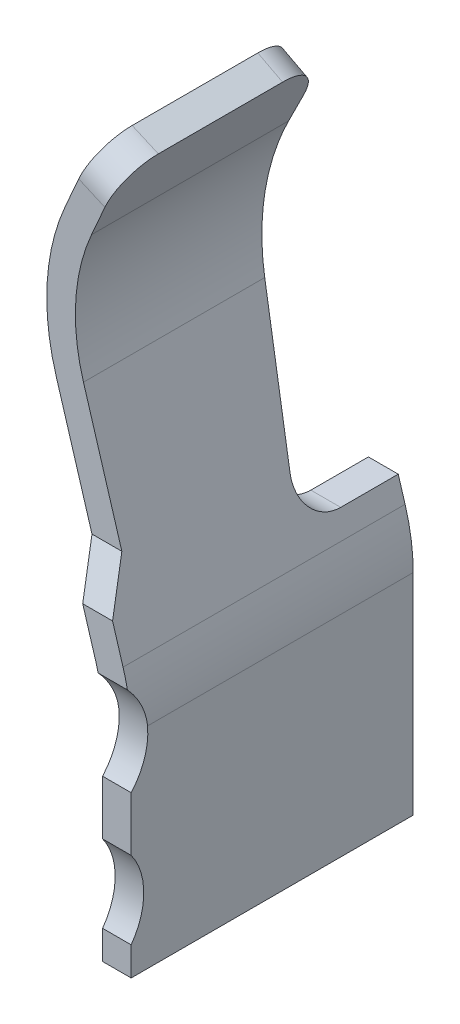
ISO-10303-21;
HEADER;
FILE_DESCRIPTION(('STEP AP214'),'2;1');
FILE_NAME('part.step','',(''),(''),'','','');
FILE_SCHEMA(('AUTOMOTIVE_DESIGN { 1 0 10303 214 1 1 1 1 }'));
ENDSEC;
DATA;
#1=APPLICATION_CONTEXT('core data for automotive mechanical design processes');
#2=APPLICATION_PROTOCOL_DEFINITION('international standard','automotive_design',2000,#1);
#3=PRODUCT_CONTEXT('',#1,'mechanical');
#4=PRODUCT('Part','Part','',(#3));
#5=PRODUCT_RELATED_PRODUCT_CATEGORY('part','',(#4));
#6=PRODUCT_DEFINITION_FORMATION('','',#4);
#7=PRODUCT_DEFINITION_CONTEXT('part definition',#1,'design');
#8=PRODUCT_DEFINITION('design','',#6,#7);
#9=PRODUCT_DEFINITION_SHAPE('','',#8);
#10=(LENGTH_UNIT() NAMED_UNIT(*) SI_UNIT(.MILLI.,.METRE.));
#11=(NAMED_UNIT(*) PLANE_ANGLE_UNIT() SI_UNIT($,.RADIAN.));
#12=(NAMED_UNIT(*) SI_UNIT($,.STERADIAN.) SOLID_ANGLE_UNIT());
#13=UNCERTAINTY_MEASURE_WITH_UNIT(LENGTH_MEASURE(1.E-05),#10,'distance_accuracy_value','');
#14=(GEOMETRIC_REPRESENTATION_CONTEXT(3) GLOBAL_UNCERTAINTY_ASSIGNED_CONTEXT((#13)) GLOBAL_UNIT_ASSIGNED_CONTEXT((#10,
#11,#12)) REPRESENTATION_CONTEXT('',''));
#15=CARTESIAN_POINT('',(0.,0.,0.));
#16=DIRECTION('',(0.,0.,1.));
#17=DIRECTION('',(1.,0.,0.));
#18=AXIS2_PLACEMENT_3D('',#15,#16,#17);
#19=CARTESIAN_POINT('',(12.0384449331811,3.52330708865174,0.423604352914839));
#20=DIRECTION('',(0.915327071470026,-0.402711251685505,0.));
#21=DIRECTION('',(0.402711251685505,0.915327071470026,0.));
#22=AXIS2_PLACEMENT_3D('',#19,#20,#21);
#23=CYLINDRICAL_SURFACE('',#22,0.2);
#24=CARTESIAN_POINT('',(12.0384449331811,3.52330708865174,0.423604352914839));
#25=DIRECTION('',(-0.915327071470029,0.402711251685498,0.));
#26=DIRECTION('',(0.402711251685498,0.915327071470029,0.));
#27=AXIS2_PLACEMENT_3D('',#24,#25,#26);
#28=CIRCLE('',#27,0.2);
#29=CARTESIAN_POINT('',(12.0384449331811,3.52330708865174,0.623604352914839));
#30=VERTEX_POINT('',#29);
#31=CARTESIAN_POINT('',(12.1189871835182,3.70637250294574,0.423604352914839));
#32=VERTEX_POINT('',#31);
#33=EDGE_CURVE('E498',#30,#32,#28,.T.);
#34=ORIENTED_EDGE('',*,*,#33,.F.);
#35=DIRECTION('',(-0.915327071470027,0.402711251685503,0.));
#36=VECTOR('',#35,1.);
#37=CARTESIAN_POINT('',(-12.5715059297135,14.3508073613119,0.623604352914805));
#38=LINE('',#37,#36);
#39=CARTESIAN_POINT('',(12.1757439939016,3.46290040089891,0.623604352914839));
#40=VERTEX_POINT('',#39);
#41=EDGE_CURVE('E27',#40,#30,#38,.T.);
#42=ORIENTED_EDGE('',*,*,#41,.F.);
#43=CARTESIAN_POINT('',(12.1757439939016,3.46290040089891,0.423604352914839));
#44=DIRECTION('',(0.915327071470029,-0.402711251685498,0.));
#45=DIRECTION('',(-0.402711251685498,-0.915327071470029,0.));
#46=AXIS2_PLACEMENT_3D('',#43,#44,#45);
#47=CIRCLE('',#46,0.2);
#48=CARTESIAN_POINT('',(12.2562862442387,3.64596581519291,0.423604352914839));
#49=VERTEX_POINT('',#48);
#50=EDGE_CURVE('E503',#49,#40,#47,.T.);
#51=ORIENTED_EDGE('',*,*,#50,.F.);
#52=DIRECTION('',(0.915327071470027,-0.402711251685503,0.));
#53=VECTOR('',#52,1.);
#54=CARTESIAN_POINT('',(12.1189871835182,3.70637250294574,0.423604352914839));
#55=LINE('',#54,#53);
#56=EDGE_CURVE('E539',#32,#49,#55,.T.);
#57=ORIENTED_EDGE('',*,*,#56,.F.);
#58=EDGE_LOOP('',(#34,#42,#51,#57));
#59=FACE_BOUND('',#58,.T.);
#60=ADVANCED_FACE('F16',(#59),#23,.T.);
#61=CARTESIAN_POINT('',(12.01613725867,3.53312166947706,-0.236832722369337));
#62=DIRECTION('',(-0.914255270392897,0.402239697454475,-0.0483789866630451));
#63=DIRECTION('',(-0.402711251685505,-0.915327071470026,0.));
#64=AXIS2_PLACEMENT_3D('',#61,#62,#63);
#65=CYLINDRICAL_SURFACE('',#64,0.2);
#66=CARTESIAN_POINT('',(12.1669405380458,3.44289092405021,-0.427421697659668));
#67=CARTESIAN_POINT('',(12.2180174651924,3.55898426375477,-0.441384710680955));
#68=CARTESIAN_POINT('',(12.2562862442387,3.64596581519291,-0.356133634256614));
#69=CARTESIAN_POINT('',(12.2562862442387,3.64596581519291,-0.228386927890316));
#70=(BOUNDED_CURVE() B_SPLINE_CURVE(3,(#66,#67,#68,#69),.UNSPECIFIED.,.F.,
.F.) B_SPLINE_CURVE_WITH_KNOTS((4,4),(6.17366415670651,7.85398163397443),
.UNSPECIFIED.) CURVE() GEOMETRIC_REPRESENTATION_ITEM() RATIONAL_B_SPLINE_CURVE((1.,
0.778229742533869,0.778229742533869,1.)) REPRESENTATION_ITEM(''));
#71=CARTESIAN_POINT('',(12.1669405380458,3.44289092405021,-0.427421697659668));
#72=VERTEX_POINT('',#71);
#73=CARTESIAN_POINT('',(12.2562862442387,3.64596581519291,-0.228386927890316));
#74=VERTEX_POINT('',#73);
#75=EDGE_CURVE('E508',#72,#74,#70,.T.);
#76=ORIENTED_EDGE('',*,*,#75,.F.);
#77=DIRECTION('',(0.914255270392898,-0.402239697454473,0.0483789866630451));
#78=VECTOR('',#77,1.);
#79=CARTESIAN_POINT('',(-13.171852655037,14.5910558161891,-1.76825633941021));
#80=LINE('',#79,#78);
#81=CARTESIAN_POINT('',(12.0296414773253,3.50329761180303,-0.434687053017796));
#82=VERTEX_POINT('',#81);
#83=EDGE_CURVE('E11',#82,#72,#80,.T.);
#84=ORIENTED_EDGE('',*,*,#83,.F.);
#85=CARTESIAN_POINT('',(12.1189871835182,3.70637250294574,-0.235652283248443));
#86=CARTESIAN_POINT('',(12.1189871835182,3.70637250294574,-0.363398989614741));
#87=CARTESIAN_POINT('',(12.0807184044719,3.61939095150759,-0.448650066039082));
#88=CARTESIAN_POINT('',(12.0296414773253,3.50329761180303,-0.434687053017796));
#89=(BOUNDED_CURVE() B_SPLINE_CURVE(3,(#85,#86,#87,#88),.UNSPECIFIED.,.F.,
.F.) B_SPLINE_CURVE_WITH_KNOTS((4,4),(4.71238898038476,6.39270645765268),
.UNSPECIFIED.) CURVE() GEOMETRIC_REPRESENTATION_ITEM() RATIONAL_B_SPLINE_CURVE((1.,
0.778229742533871,0.778229742533871,1.)) REPRESENTATION_ITEM(''));
#90=CARTESIAN_POINT('',(12.1189871835182,3.70637250294574,-0.235652283248443));
#91=VERTEX_POINT('',#90);
#92=EDGE_CURVE('E244',#91,#82,#89,.T.);
#93=ORIENTED_EDGE('',*,*,#92,.F.);
#94=DIRECTION('',(-0.914255270392898,0.402239697454473,-0.0483789866630451));
#95=VECTOR('',#94,1.);
#96=CARTESIAN_POINT('',(12.0966795090071,3.71618708377106,-0.236832722369337));
#97=LINE('',#96,#95);
#98=EDGE_CURVE('E497',#74,#91,#97,.T.);
#99=ORIENTED_EDGE('',*,*,#98,.F.);
#100=EDGE_LOOP('',(#76,#84,#93,#99));
#101=FACE_BOUND('',#100,.T.);
#102=ADVANCED_FACE('F326',(#101),#65,.T.);
#103=CARTESIAN_POINT('',(-18.03,1.65634067151207,-0.212546111318104));
#104=DIRECTION('',(0.,-1.,0.));
#105=DIRECTION('',(0.,0.,-1.));
#106=AXIS2_PLACEMENT_3D('',#103,#104,#105);
#107=PLANE('',#106);
#108=DIRECTION('',(0.,0.,-1.));
#109=VECTOR('',#108,1.);
#110=CARTESIAN_POINT('',(12.1948350789415,1.65634067151207,-0.740000000000018));
#111=LINE('',#110,#109);
#112=CARTESIAN_POINT('',(12.1948350789415,1.65634067151207,-0.438042305987952));
#113=VERTEX_POINT('',#112);
#114=CARTESIAN_POINT('',(12.1948350789415,1.65634067151207,-0.740000000000018));
#115=VERTEX_POINT('',#114);
#116=EDGE_CURVE('E492',#113,#115,#111,.T.);
#117=ORIENTED_EDGE('',*,*,#116,.F.);
#118=DIRECTION('',(1.,0.,0.));
#119=VECTOR('',#118,1.);
#120=CARTESIAN_POINT('',(12.3515034091056,1.65634067151207,-0.438042305987951));
#121=LINE('',#120,#119);
#122=CARTESIAN_POINT('',(12.3515034091056,1.65634067151207,-0.438042305987951));
#123=VERTEX_POINT('',#122);
#124=EDGE_CURVE('E456',#113,#123,#121,.T.);
#125=ORIENTED_EDGE('',*,*,#124,.T.);
#126=DIRECTION('',(0.,0.,1.));
#127=VECTOR('',#126,1.);
#128=CARTESIAN_POINT('',(12.3515034091056,1.65634067151207,-0.740000000000018));
#129=LINE('',#128,#127);
#130=CARTESIAN_POINT('',(12.3515034091056,1.65634067151207,-0.740000000000018));
#131=VERTEX_POINT('',#130);
#132=EDGE_CURVE('E524',#131,#123,#129,.T.);
#133=ORIENTED_EDGE('',*,*,#132,.F.);
#134=DIRECTION('',(-1.,0.,0.));
#135=VECTOR('',#134,1.);
#136=CARTESIAN_POINT('',(11.43,1.65634067151207,-0.740000000000019));
#137=LINE('',#136,#135);
#138=EDGE_CURVE('E254',#131,#115,#137,.T.);
#139=ORIENTED_EDGE('',*,*,#138,.T.);
#140=EDGE_LOOP('',(#117,#125,#133,#139));
#141=FACE_BOUND('',#140,.T.);
#142=ADVANCED_FACE('F362',(#141),#107,.F.);
#143=CARTESIAN_POINT('',(-18.03,3.70637250294571,-0.459111687165995));
#144=DIRECTION('',(0.,0.119413416546905,0.992844618230162));
#145=DIRECTION('',(1.,0.,0.));
#146=AXIS2_PLACEMENT_3D('',#143,#144,#145);
#147=PLANE('',#146);
#148=DIRECTION('',(-0.28674853992682,0.951150986717314,-0.11439875574724));
#149=VECTOR('',#148,1.);
#150=CARTESIAN_POINT('',(12.3696639548885,1.59610175610151,-0.205300934614502));
#151=LINE('',#150,#149);
#152=CARTESIAN_POINT('',(12.2840083074336,1.88022335482146,-0.239473382341919));
#153=VERTEX_POINT('',#152);
#154=CARTESIAN_POINT('',(12.0634137359037,2.61194022573825,-0.327479914176621));
#155=VERTEX_POINT('',#154);
#156=EDGE_CURVE('E521',#153,#155,#151,.T.);
#157=ORIENTED_EDGE('',*,*,#156,.F.);
#158=DIRECTION('',(-1.,0.,0.));
#159=VECTOR('',#158,1.);
#160=CARTESIAN_POINT('',(12.1948350789415,1.88022335482146,-0.23947338234192));
#161=LINE('',#160,#159);
#162=CARTESIAN_POINT('',(12.1273399772696,1.88022335482146,-0.23947338234192));
#163=VERTEX_POINT('',#162);
#164=EDGE_CURVE('E255',#153,#163,#161,.T.);
#165=ORIENTED_EDGE('',*,*,#164,.T.);
#166=DIRECTION('',(0.286748539926818,-0.951150986717315,0.11439875574724));
#167=VECTOR('',#166,1.);
#168=CARTESIAN_POINT('',(12.2258776351119,1.55337185451571,-0.200161637444145));
#169=LINE('',#168,#167);
#170=CARTESIAN_POINT('',(11.9197982395462,2.56864369924933,-0.322272466749579));
#171=VERTEX_POINT('',#170);
#172=EDGE_CURVE('E520',#171,#163,#169,.T.);
#173=ORIENTED_EDGE('',*,*,#172,.F.);
#174=CARTESIAN_POINT('',(11.9682242460961,3.36370167510267,-0.417897288102545));
#175=CARTESIAN_POINT('',(11.8566992050933,3.11021511680704,-0.387409439934768));
#176=CARTESIAN_POINT('',(11.839862605404,2.83379189253285,-0.354162906673266));
#177=CARTESIAN_POINT('',(11.9197982395462,2.56864369924933,-0.322272466749579));
#178=(BOUNDED_CURVE() B_SPLINE_CURVE(3,(#174,#175,#176,#177),.UNSPECIFIED.,.F.,
.F.) B_SPLINE_CURVE_WITH_KNOTS((4,4),(4.29791199977039,5.00519872138853),
.UNSPECIFIED.) CURVE() GEOMETRIC_REPRESENTATION_ITEM() RATIONAL_B_SPLINE_CURVE((1.,
0.958744787021091,0.958744787021091,1.)) REPRESENTATION_ITEM(''));
#179=CARTESIAN_POINT('',(11.9682242460961,3.36370167510267,-0.417897288102545));
#180=VERTEX_POINT('',#179);
#181=EDGE_CURVE('E452',#180,#171,#178,.T.);
#182=ORIENTED_EDGE('',*,*,#181,.F.);
#183=DIRECTION('',(-0.400292818236851,-0.909830186054405,0.109428936813832));
#184=VECTOR('',#183,1.);
#185=CARTESIAN_POINT('',(11.9823335100882,3.39577078475993,-0.421754368938234));
#186=LINE('',#185,#184);
#187=EDGE_CURVE('E546',#82,#180,#186,.T.);
#188=ORIENTED_EDGE('',*,*,#187,.F.);
#189=ORIENTED_EDGE('',*,*,#83,.T.);
#190=DIRECTION('',(0.400292818236852,0.909830186054405,-0.109428936813832));
#191=VECTOR('',#190,1.);
#192=CARTESIAN_POINT('',(12.1199508196559,3.33608744850051,-0.414576013974332));
#193=LINE('',#192,#191);
#194=CARTESIAN_POINT('',(12.1055233068166,3.30329498734983,-0.410631932744417));
#195=VERTEX_POINT('',#194);
#196=EDGE_CURVE('E530',#195,#72,#193,.T.);
#197=ORIENTED_EDGE('',*,*,#196,.F.);
#198=CARTESIAN_POINT('',(12.0634137359037,2.61194022573825,-0.327479914176621));
#199=CARTESIAN_POINT('',(11.9939044888234,2.84250387207174,-0.355210731501565));
#200=CARTESIAN_POINT('',(12.0085450102924,3.08287189317973,-0.384120760424611));
#201=CARTESIAN_POINT('',(12.1055233068166,3.30329498734983,-0.410631932744417));
#202=(BOUNDED_CURVE() B_SPLINE_CURVE(3,(#198,#199,#200,#201),.UNSPECIFIED.,.F.,
.F.) B_SPLINE_CURVE_WITH_KNOTS((4,4),(1.27798658579106,1.98527330740919),
.UNSPECIFIED.) CURVE() GEOMETRIC_REPRESENTATION_ITEM() RATIONAL_B_SPLINE_CURVE((1.,
0.958744787021091,0.958744787021091,1.)) REPRESENTATION_ITEM(''));
#203=EDGE_CURVE('E279',#155,#195,#202,.T.);
#204=ORIENTED_EDGE('',*,*,#203,.F.);
#205=EDGE_LOOP('',(#157,#165,#173,#182,#188,#189,#197,#204));
#206=FACE_BOUND('',#205,.T.);
#207=ADVANCED_FACE('F674',(#206),#147,.F.);
#208=CARTESIAN_POINT('',(-18.03,1.94413292378283,0.623604352914797));
#209=DIRECTION('',(0.,0.,-1.));
#210=DIRECTION('',(0.,-1.,0.));
#211=AXIS2_PLACEMENT_3D('',#208,#209,#210);
#212=PLANE('',#211);
#213=DIRECTION('',(-0.402711251685501,-0.915327071470028,0.));
#214=VECTOR('',#213,1.);
#215=CARTESIAN_POINT('',(12.1055233068166,3.30329498734984,0.623604352914839));
#216=LINE('',#215,#214);
#217=CARTESIAN_POINT('',(12.1055233068166,3.30329498734984,0.623604352914839));
#218=VERTEX_POINT('',#217);
#219=EDGE_CURVE('E507',#40,#218,#216,.T.);
#220=ORIENTED_EDGE('',*,*,#219,.F.);
#221=ORIENTED_EDGE('',*,*,#41,.T.);
#222=DIRECTION('',(0.4027112516855,0.915327071470028,0.));
#223=VECTOR('',#222,1.);
#224=CARTESIAN_POINT('',(11.9682242460961,3.36370167510267,0.623604352914839));
#225=LINE('',#224,#223);
#226=CARTESIAN_POINT('',(11.9682242460961,3.36370167510267,0.623604352914839));
#227=VERTEX_POINT('',#226);
#228=EDGE_CURVE('E542',#227,#30,#225,.T.);
#229=ORIENTED_EDGE('',*,*,#228,.F.);
#230=CARTESIAN_POINT('',(13.0208503782866,2.90058373566433,0.62360435291484));
#231=DIRECTION('',(0.,0.,-1.));
#232=DIRECTION('',(-1.,0.,0.));
#233=AXIS2_PLACEMENT_3D('',#230,#231,#232);
#234=CIRCLE('',#233,1.15);
#235=CARTESIAN_POINT('',(11.9197982395462,2.56864369924933,0.623604352914839));
#236=VERTEX_POINT('',#235);
#237=EDGE_CURVE('E245',#236,#227,#234,.T.);
#238=ORIENTED_EDGE('',*,*,#237,.F.);
#239=DIRECTION('',(-0.288643509926088,0.957436642382956,0.));
#240=VECTOR('',#239,1.);
#241=CARTESIAN_POINT('',(12.2438211460255,1.49385284836845,0.623604352914839));
#242=LINE('',#241,#240);
#243=CARTESIAN_POINT('',(12.1080728200643,1.94413292378283,0.623604352914839));
#244=VERTEX_POINT('',#243);
#245=EDGE_CURVE('E536',#244,#236,#242,.T.);
#246=ORIENTED_EDGE('',*,*,#245,.F.);
#247=DIRECTION('',(1.,0.,0.));
#248=VECTOR('',#247,1.);
#249=CARTESIAN_POINT('',(-18.03,1.94413292378283,0.623604352914797));
#250=LINE('',#249,#248);
#251=CARTESIAN_POINT('',(12.2647411502284,1.94413292378283,0.623604352914839));
#252=VERTEX_POINT('',#251);
#253=EDGE_CURVE('E575',#244,#252,#250,.T.);
#254=ORIENTED_EDGE('',*,*,#253,.T.);
#255=DIRECTION('',(0.28864350992609,-0.957436642382956,0.));
#256=VECTOR('',#255,1.);
#257=CARTESIAN_POINT('',(12.387436642383,1.53714937485737,0.623604352914839));
#258=LINE('',#257,#256);
#259=CARTESIAN_POINT('',(12.0634137359037,2.61194022573825,0.623604352914839));
#260=VERTEX_POINT('',#259);
#261=EDGE_CURVE('E523',#260,#252,#258,.T.);
#262=ORIENTED_EDGE('',*,*,#261,.F.);
#263=CARTESIAN_POINT('',(13.0208503782866,2.90058373566433,0.62360435291484));
#264=DIRECTION('',(0.,0.,1.));
#265=DIRECTION('',(-1.,0.,0.));
#266=AXIS2_PLACEMENT_3D('',#263,#264,#265);
#267=CIRCLE('',#266,1.);
#268=EDGE_CURVE('E274',#218,#260,#267,.T.);
#269=ORIENTED_EDGE('',*,*,#268,.F.);
#270=EDGE_LOOP('',(#220,#221,#229,#238,#246,#254,#262,#269));
#271=FACE_BOUND('',#270,.T.);
#272=ADVANCED_FACE('F680',(#271),#212,.F.);
#273=CARTESIAN_POINT('',(-18.03,1.7003498353216,0.749999999999972));
#274=DIRECTION('',(0.,-0.460287319631494,-0.887770005906065));
#275=DIRECTION('',(0.,-0.887770005906065,0.460287319631494));
#276=AXIS2_PLACEMENT_3D('',#273,#274,#275);
#277=PLANE('',#276);
#278=DIRECTION('',(-1.,0.,0.));
#279=VECTOR('',#278,1.);
#280=CARTESIAN_POINT('',(11.43,1.7196371362757,0.739999999999981));
#281=LINE('',#280,#279);
#282=CARTESIAN_POINT('',(12.3324210876793,1.7196371362757,0.739999999999982));
#283=VERTEX_POINT('',#282);
#284=CARTESIAN_POINT('',(12.1757527575152,1.7196371362757,0.739999999999982));
#285=VERTEX_POINT('',#284);
#286=EDGE_CURVE('E486',#283,#285,#281,.T.);
#287=ORIENTED_EDGE('',*,*,#286,.F.);
#288=DIRECTION('',(0.258541028225372,-0.857586072334425,0.444637678635293));
#289=VECTOR('',#288,1.);
#290=CARTESIAN_POINT('',(12.2064234383064,2.13757401070795,0.523309818502748));
#291=LINE('',#290,#289);
#292=EDGE_CURVE('E251',#252,#283,#291,.T.);
#293=ORIENTED_EDGE('',*,*,#292,.F.);
#294=ORIENTED_EDGE('',*,*,#253,.F.);
#295=DIRECTION('',(-0.258541028225371,0.857586072334425,-0.444637678635293));
#296=VECTOR('',#295,1.);
#297=CARTESIAN_POINT('',(12.0602273619162,2.10283732290249,0.541319952677684));
#298=LINE('',#297,#296);
#299=EDGE_CURVE('E491',#285,#244,#298,.T.);
#300=ORIENTED_EDGE('',*,*,#299,.F.);
#301=EDGE_LOOP('',(#287,#293,#294,#300));
#302=FACE_BOUND('',#301,.T.);
#303=ADVANCED_FACE('F695',(#302),#277,.F.);
#304=CARTESIAN_POINT('',(11.43,1.24850586493128,0.739999999999981));
#305=DIRECTION('',(0.,0.,-1.));
#306=DIRECTION('',(0.,-1.,0.));
#307=AXIS2_PLACEMENT_3D('',#304,#305,#306);
#308=PLANE('',#307);
#309=DIRECTION('',(0.,-1.,0.));
#310=VECTOR('',#309,1.);
#311=CARTESIAN_POINT('',(12.43,0.145965815192914,0.739999999999982));
#312=LINE('',#311,#310);
#313=CARTESIAN_POINT('',(12.43,0.296740599868486,0.739999999999982));
#314=VERTEX_POINT('',#313);
#315=CARTESIAN_POINT('',(12.43,0.145965815192914,0.739999999999982));
#316=VERTEX_POINT('',#315);
#317=EDGE_CURVE('E201',#314,#316,#312,.T.);
#318=ORIENTED_EDGE('',*,*,#317,.F.);
#319=DIRECTION('',(-1.,0.,0.));
#320=VECTOR('',#319,1.);
#321=CARTESIAN_POINT('',(-18.03,0.296740599868486,0.73999999999994));
#322=LINE('',#321,#320);
#323=CARTESIAN_POINT('',(12.28,0.296740599868486,0.739999999999982));
#324=VERTEX_POINT('',#323);
#325=EDGE_CURVE('E205',#314,#324,#322,.T.);
#326=ORIENTED_EDGE('',*,*,#325,.T.);
#327=DIRECTION('',(0.,1.,0.));
#328=VECTOR('',#327,1.);
#329=CARTESIAN_POINT('',(12.28,0.145965815192914,0.739999999999982));
#330=LINE('',#329,#328);
#331=CARTESIAN_POINT('',(12.28,0.145965815192914,0.739999999999982));
#332=VERTEX_POINT('',#331);
#333=EDGE_CURVE('E502',#332,#324,#330,.T.);
#334=ORIENTED_EDGE('',*,*,#333,.F.);
#335=DIRECTION('',(-1.,0.,0.));
#336=VECTOR('',#335,1.);
#337=CARTESIAN_POINT('',(12.28,0.145965815192914,0.739999999999982));
#338=LINE('',#337,#336);
#339=EDGE_CURVE('E208',#316,#332,#338,.T.);
#340=ORIENTED_EDGE('',*,*,#339,.F.);
#341=EDGE_LOOP('',(#318,#326,#334,#340));
#342=FACE_BOUND('',#341,.T.);
#343=ADVANCED_FACE('F203',(#342),#308,.F.);
#344=CARTESIAN_POINT('',(11.43,1.24850586493128,-0.740000000000019));
#345=DIRECTION('',(0.,0.,-1.));
#346=DIRECTION('',(0.,-1.,0.));
#347=AXIS2_PLACEMENT_3D('',#344,#345,#346);
#348=PLANE('',#347);
#349=ORIENTED_EDGE('',*,*,#138,.F.);
#350=DIRECTION('',(0.28864350992609,-0.957436642382956,0.));
#351=VECTOR('',#350,1.);
#352=CARTESIAN_POINT('',(12.387436642383,1.53714937485737,-0.740000000000018));
#353=LINE('',#352,#351);
#354=CARTESIAN_POINT('',(12.387436642383,1.53714937485737,-0.740000000000018));
#355=VERTEX_POINT('',#354);
#356=EDGE_CURVE('E278',#131,#355,#353,.T.);
#357=ORIENTED_EDGE('',*,*,#356,.T.);
#358=CARTESIAN_POINT('',(11.43,1.24850586493128,-0.740000000000019));
#359=DIRECTION('',(0.,0.,-1.));
#360=DIRECTION('',(-1.,0.,0.));
#361=AXIS2_PLACEMENT_3D('',#358,#359,#360);
#362=CIRCLE('',#361,1.);
#363=CARTESIAN_POINT('',(12.43,1.24850586493128,-0.740000000000018));
#364=VERTEX_POINT('',#363);
#365=EDGE_CURVE('E211',#355,#364,#362,.T.);
#366=ORIENTED_EDGE('',*,*,#365,.T.);
#367=DIRECTION('',(0.,-1.,0.));
#368=VECTOR('',#367,1.);
#369=CARTESIAN_POINT('',(12.43,0.145965815192914,-0.740000000000018));
#370=LINE('',#369,#368);
#371=CARTESIAN_POINT('',(12.43,0.145965815192914,-0.740000000000018));
#372=VERTEX_POINT('',#371);
#373=EDGE_CURVE('E42',#364,#372,#370,.T.);
#374=ORIENTED_EDGE('',*,*,#373,.T.);
#375=DIRECTION('',(-1.,0.,0.));
#376=VECTOR('',#375,1.);
#377=CARTESIAN_POINT('',(12.28,0.145965815192914,-0.740000000000018));
#378=LINE('',#377,#376);
#379=CARTESIAN_POINT('',(12.28,0.145965815192914,-0.740000000000018));
#380=VERTEX_POINT('',#379);
#381=EDGE_CURVE('E273',#372,#380,#378,.T.);
#382=ORIENTED_EDGE('',*,*,#381,.T.);
#383=DIRECTION('',(0.,1.,0.));
#384=VECTOR('',#383,1.);
#385=CARTESIAN_POINT('',(12.28,0.145965815192914,-0.740000000000018));
#386=LINE('',#385,#384);
#387=CARTESIAN_POINT('',(12.28,1.24850586493128,-0.740000000000018));
#388=VERTEX_POINT('',#387);
#389=EDGE_CURVE('E376',#380,#388,#386,.T.);
#390=ORIENTED_EDGE('',*,*,#389,.T.);
#391=CARTESIAN_POINT('',(11.43,1.24850586493128,-0.740000000000019));
#392=DIRECTION('',(0.,0.,1.));
#393=DIRECTION('',(-1.,0.,0.));
#394=AXIS2_PLACEMENT_3D('',#391,#392,#393);
#395=CIRCLE('',#394,0.85);
#396=CARTESIAN_POINT('',(12.2438211460255,1.49385284836845,-0.740000000000018));
#397=VERTEX_POINT('',#396);
#398=EDGE_CURVE('E556',#388,#397,#395,.T.);
#399=ORIENTED_EDGE('',*,*,#398,.T.);
#400=DIRECTION('',(-0.288643509926088,0.957436642382956,0.));
#401=VECTOR('',#400,1.);
#402=CARTESIAN_POINT('',(12.2438211460255,1.49385284836845,-0.740000000000018));
#403=LINE('',#402,#401);
#404=EDGE_CURVE('E487',#397,#115,#403,.T.);
#405=ORIENTED_EDGE('',*,*,#404,.T.);
#406=EDGE_LOOP('',(#349,#357,#366,#374,#382,#390,#399,#405));
#407=FACE_BOUND('',#406,.T.);
#408=ADVANCED_FACE('F432',(#407),#348,.T.);
#409=CARTESIAN_POINT('',(12.43,0.145965815192914,-0.740000000000018));
#410=DIRECTION('',(-1.,0.,0.));
#411=DIRECTION('',(0.,0.,1.));
#412=AXIS2_PLACEMENT_3D('',#409,#410,#411);
#413=PLANE('',#412);
#414=DIRECTION('',(0.,0.,1.));
#415=VECTOR('',#414,1.);
#416=CARTESIAN_POINT('',(12.43,1.24850586493128,-0.740000000000018));
#417=LINE('',#416,#415);
#418=CARTESIAN_POINT('',(12.43,1.24850586493128,0.654029100989327));
#419=VERTEX_POINT('',#418);
#420=EDGE_CURVE('E250',#364,#419,#417,.T.);
#421=ORIENTED_EDGE('',*,*,#420,.T.);
#422=CARTESIAN_POINT('',(12.43,1.21669179396546,0.995153761033099));
#423=DIRECTION('',(1.,0.,0.));
#424=DIRECTION('',(0.,0.,1.));
#425=AXIS2_PLACEMENT_3D('',#422,#423,#424);
#426=CIRCLE('',#425,0.342604974863759);
#427=CARTESIAN_POINT('',(12.43,0.988055123608201,0.739999999999982));
#428=VERTEX_POINT('',#427);
#429=EDGE_CURVE('E404',#428,#419,#426,.T.);
#430=ORIENTED_EDGE('',*,*,#429,.F.);
#431=DIRECTION('',(0.,-1.,0.));
#432=VECTOR('',#431,1.);
#433=CARTESIAN_POINT('',(12.43,0.145965815192914,0.739999999999982));
#434=LINE('',#433,#432);
#435=CARTESIAN_POINT('',(12.43,0.703259400131467,0.739999999999982));
#436=VERTEX_POINT('',#435);
#437=EDGE_CURVE('E217',#428,#436,#434,.T.);
#438=ORIENTED_EDGE('',*,*,#437,.T.);
#439=CARTESIAN_POINT('',(12.43,0.499999999999977,1.01942683457021));
#440=DIRECTION('',(1.,0.,0.));
#441=DIRECTION('',(0.,0.,1.));
#442=AXIS2_PLACEMENT_3D('',#439,#440,#441);
#443=CIRCLE('',#442,0.345533991988848);
#444=EDGE_CURVE('E214',#314,#436,#443,.T.);
#445=ORIENTED_EDGE('',*,*,#444,.F.);
#446=ORIENTED_EDGE('',*,*,#317,.T.);
#447=DIRECTION('',(0.,0.,1.));
#448=VECTOR('',#447,1.);
#449=CARTESIAN_POINT('',(12.43,0.145965815192914,-0.740000000000018));
#450=LINE('',#449,#448);
#451=EDGE_CURVE('E377',#372,#316,#450,.T.);
#452=ORIENTED_EDGE('',*,*,#451,.F.);
#453=ORIENTED_EDGE('',*,*,#373,.F.);
#454=EDGE_LOOP('',(#421,#430,#438,#445,#446,#452,#453));
#455=FACE_BOUND('',#454,.T.);
#456=ADVANCED_FACE('F215',(#455),#413,.F.);
#457=CARTESIAN_POINT('',(11.43,1.24850586493128,-0.740000000000019));
#458=DIRECTION('',(0.,0.,1.));
#459=DIRECTION('',(1.,0.,0.));
#460=AXIS2_PLACEMENT_3D('',#457,#458,#459);
#461=CYLINDRICAL_SURFACE('',#460,1.);
#462=CARTESIAN_POINT('',(11.43,1.24850586493128,0.739999999999981));
#463=DIRECTION('',(0.,0.,-1.));
#464=DIRECTION('',(-1.,0.,0.));
#465=AXIS2_PLACEMENT_3D('',#462,#463,#464);
#466=CIRCLE('',#465,1.);
#467=CARTESIAN_POINT('',(12.387436642383,1.53714937485737,0.739999999999982));
#468=VERTEX_POINT('',#467);
#469=CARTESIAN_POINT('',(12.4104391181347,1.44532846432271,0.739999999999982));
#470=VERTEX_POINT('',#469);
#471=EDGE_CURVE('E349',#468,#470,#466,.T.);
#472=ORIENTED_EDGE('',*,*,#471,.T.);
#473=CARTESIAN_POINT('',(12.4104391181347,1.44532846432271,0.739999999999982));
#474=CARTESIAN_POINT('',(12.4111213174168,1.44193024717415,0.736954698545483));
#475=CARTESIAN_POINT('',(12.4117972185085,1.43847176034261,0.733975045899647));
#476=CARTESIAN_POINT('',(12.413128559526,1.43145643098154,0.728168909339827));
#477=CARTESIAN_POINT('',(12.4137840893163,1.42790021102147,0.725341693611728));
#478=CARTESIAN_POINT('',(12.4150716881698,1.42068928784935,0.719840380711008));
#479=CARTESIAN_POINT('',(12.4157038382793,1.41703501951568,0.717165732805341));
#480=CARTESIAN_POINT('',(12.4169415721266,1.40962817005595,0.711969336935122));
#481=CARTESIAN_POINT('',(12.4175472155213,1.40587584366096,0.709447240161576));
#482=CARTESIAN_POINT('',(12.4187287712969,1.39827302810681,0.704555749407115));
#483=CARTESIAN_POINT('',(12.4193047088885,1.3944226264711,0.702186225501711));
#484=CARTESIAN_POINT('',(12.420423617226,1.38662388081484,0.697599649617144));
#485=CARTESIAN_POINT('',(12.4209665658168,1.3826754734274,0.69538269997563));
#486=CARTESIAN_POINT('',(12.42201619605,1.37468096295884,0.691101059928042));
#487=CARTESIAN_POINT('',(12.4225227957389,1.3706346650176,0.689036713287184));
#488=CARTESIAN_POINT('',(12.423496351594,1.36244473872731,0.685059955148846));
#489=CARTESIAN_POINT('',(12.4239631543961,1.35830080604147,0.683148133100285));
#490=CARTESIAN_POINT('',(12.4248538510173,1.34991442649085,0.679475891500457));
#491=CARTESIAN_POINT('',(12.425277495071,1.3456715635432,0.677716361222163));
#492=CARTESIAN_POINT('',(12.4260735280579,1.33713872195209,0.67437603386877));
#493=CARTESIAN_POINT('',(12.426446189351,1.33284913740262,0.672794295796519));
#494=CARTESIAN_POINT('',(12.4271386385479,1.32422362544475,0.669809238507238));
#495=CARTESIAN_POINT('',(12.42745863415,1.31988795555412,0.668405223722607));
#496=CARTESIAN_POINT('',(12.4280441441101,1.31117101253237,0.665775382478343));
#497=CARTESIAN_POINT('',(12.4283097914247,1.3067898789237,0.664549123358626));
#498=CARTESIAN_POINT('',(12.4287849936785,1.29798278695386,0.662274523841756));
#499=CARTESIAN_POINT('',(12.4289945979607,1.29355687160833,0.661226027233363));
#500=CARTESIAN_POINT('',(12.4293561122408,1.28466100981363,0.659306657193394));
#501=CARTESIAN_POINT('',(12.4295079805488,1.28019103392972,0.658435912321199));
#502=CARTESIAN_POINT('',(12.4297523915187,1.27120787033419,0.656871822149776));
#503=CARTESIAN_POINT('',(12.4298447957013,1.26669460642045,0.656178893183953));
#504=CARTESIAN_POINT('',(12.4299687563761,1.25762568522575,0.654969909316684));
#505=CARTESIAN_POINT('',(12.430000074122,1.25306993125333,0.654454554866669));
#506=CARTESIAN_POINT('',(12.43,1.24850586493128,0.654029100989326));
#507=B_SPLINE_CURVE_WITH_KNOTS('',3,(#473,#474,#475,#476,#477,#478,#479,#480,#481,#482,#483,
#484,#485,#486,#487,#488,#489,#490,#491,#492,#493,#494,#495,#496,#497,#498,#499,#500,#501,#502,
#503,#504,#505,#506),.UNSPECIFIED.,.F.,.F.,(4,2,2,2,2,2,2,2,2,2,2,2,2,2,2,2,4),(0.,
0.0138407212062908,0.0276076629972265,0.0413212735163106,0.0550022400255599,0.0686713979832381,
0.082349636792183,0.0960578043230462,0.109816612381111,0.123650992269169,0.137408310969936,
0.151110002599828,0.164777762983117,0.178433449670592,0.192098978145682,0.205796216649631,
0.219546882133365),.UNSPECIFIED.);
#508=EDGE_CURVE('E344',#470,#419,#507,.T.);
#509=ORIENTED_EDGE('',*,*,#508,.T.);
#510=ORIENTED_EDGE('',*,*,#420,.F.);
#511=ORIENTED_EDGE('',*,*,#365,.F.);
#512=DIRECTION('',(0.,0.,1.));
#513=VECTOR('',#512,1.);
#514=CARTESIAN_POINT('',(12.387436642383,1.53714937485737,-0.740000000000018));
#515=LINE('',#514,#513);
#516=EDGE_CURVE('E246',#355,#468,#515,.T.);
#517=ORIENTED_EDGE('',*,*,#516,.T.);
#518=EDGE_LOOP('',(#472,#509,#510,#511,#517));
#519=FACE_BOUND('',#518,.T.);
#520=ADVANCED_FACE('F320',(#519),#461,.T.);
#521=CARTESIAN_POINT('',(12.387436642383,1.53714937485737,-0.740000000000018));
#522=DIRECTION('',(-0.957436642382956,-0.28864350992609,0.));
#523=DIRECTION('',(-0.28864350992609,0.957436642382956,0.));
#524=AXIS2_PLACEMENT_3D('',#521,#522,#523);
#525=PLANE('',#524);
#526=ORIENTED_EDGE('',*,*,#356,.F.);
#527=ORIENTED_EDGE('',*,*,#132,.T.);
#528=CARTESIAN_POINT('',(12.3515034091056,1.65634067151207,-0.438042305987951));
#529=CARTESIAN_POINT('',(12.3515034091056,1.65634067151208,-0.320885018462571));
#530=CARTESIAN_POINT('',(12.3265283765635,1.73918338398669,-0.238042305987951));
#531=CARTESIAN_POINT('',(12.2912083468218,1.85634067151208,-0.238042305987952));
#532=(BOUNDED_CURVE() B_SPLINE_CURVE(3,(#528,#529,#530,#531),.UNSPECIFIED.,.F.,
.F.) B_SPLINE_CURVE_WITH_KNOTS((4,4),(3.1415926535898,4.71238898038469),
.UNSPECIFIED.) CURVE() GEOMETRIC_REPRESENTATION_ITEM() RATIONAL_B_SPLINE_CURVE((1.,
0.804737854124365,0.804737854124365,1.)) REPRESENTATION_ITEM(''));
#533=CARTESIAN_POINT('',(12.2912083468218,1.85634067151208,-0.238042305987952));
#534=VERTEX_POINT('',#533);
#535=EDGE_CURVE('E458',#123,#534,#532,.T.);
#536=ORIENTED_EDGE('',*,*,#535,.T.);
#537=CARTESIAN_POINT('',(12.2912083468218,1.85634067151208,-0.238042305987952));
#538=CARTESIAN_POINT('',(12.2888011555845,1.86432537588468,-0.238042305987952));
#539=CARTESIAN_POINT('',(12.2863982742986,1.87229578405696,-0.23851990151267));
#540=CARTESIAN_POINT('',(12.2840083074336,1.88022335482146,-0.239473382341919));
#541=(BOUNDED_CURVE() B_SPLINE_CURVE(3,(#537,#538,#539,#540),.UNSPECIFIED.,.F.,
.F.) B_SPLINE_CURVE_WITH_KNOTS((4,4),(4.71238898038469,4.83208803082147),
.UNSPECIFIED.) CURVE() GEOMETRIC_REPRESENTATION_ITEM() RATIONAL_B_SPLINE_CURVE((1.,
0.998806367803328,0.998806367803328,1.)) REPRESENTATION_ITEM(''));
#542=EDGE_CURVE('E468',#534,#153,#541,.T.);
#543=ORIENTED_EDGE('',*,*,#542,.T.);
#544=ORIENTED_EDGE('',*,*,#156,.T.);
#545=DIRECTION('',(0.,0.,1.));
#546=VECTOR('',#545,1.);
#547=CARTESIAN_POINT('',(12.0634137359037,2.61194022573825,-0.740000000000018));
#548=LINE('',#547,#546);
#549=EDGE_CURVE('E551',#155,#260,#548,.T.);
#550=ORIENTED_EDGE('',*,*,#549,.T.);
#551=ORIENTED_EDGE('',*,*,#261,.T.);
#552=ORIENTED_EDGE('',*,*,#292,.T.);
#553=DIRECTION('',(0.28864350992609,-0.957436642382956,0.));
#554=VECTOR('',#553,1.);
#555=CARTESIAN_POINT('',(12.387436642383,1.53714937485737,0.739999999999982));
#556=LINE('',#555,#554);
#557=EDGE_CURVE('E239',#283,#468,#556,.T.);
#558=ORIENTED_EDGE('',*,*,#557,.T.);
#559=ORIENTED_EDGE('',*,*,#516,.F.);
#560=EDGE_LOOP('',(#526,#527,#536,#543,#544,#550,#551,#552,#558,#559));
#561=FACE_BOUND('',#560,.T.);
#562=ADVANCED_FACE('F324',(#561),#525,.F.);
#563=CARTESIAN_POINT('',(13.0208503782866,2.90058373566433,-0.740000000000017));
#564=DIRECTION('',(0.,0.,1.));
#565=DIRECTION('',(1.,0.,0.));
#566=AXIS2_PLACEMENT_3D('',#563,#564,#565);
#567=CYLINDRICAL_SURFACE('',#566,1.);
#568=ORIENTED_EDGE('',*,*,#549,.F.);
#569=ORIENTED_EDGE('',*,*,#203,.T.);
#570=DIRECTION('',(0.,0.,1.));
#571=VECTOR('',#570,1.);
#572=CARTESIAN_POINT('',(12.1055233068166,3.30329498734983,-0.740000000000018));
#573=LINE('',#572,#571);
#574=EDGE_CURVE('E547',#195,#218,#573,.T.);
#575=ORIENTED_EDGE('',*,*,#574,.T.);
#576=ORIENTED_EDGE('',*,*,#268,.T.);
#577=EDGE_LOOP('',(#568,#569,#575,#576));
#578=FACE_BOUND('',#577,.T.);
#579=ADVANCED_FACE('F688',(#578),#567,.F.);
#580=CARTESIAN_POINT('',(12.1055233068166,3.30329498734984,-0.740000000000018));
#581=DIRECTION('',(-0.915327071470028,0.402711251685501,0.));
#582=DIRECTION('',(0.,0.,1.));
#583=AXIS2_PLACEMENT_3D('',#580,#581,#582);
#584=PLANE('',#583);
#585=ORIENTED_EDGE('',*,*,#196,.T.);
#586=ORIENTED_EDGE('',*,*,#75,.T.);
#587=DIRECTION('',(0.,0.,1.));
#588=VECTOR('',#587,1.);
#589=CARTESIAN_POINT('',(12.2562862442387,3.64596581519291,-0.740000000000018));
#590=LINE('',#589,#588);
#591=EDGE_CURVE('E493',#74,#49,#590,.T.);
#592=ORIENTED_EDGE('',*,*,#591,.T.);
#593=ORIENTED_EDGE('',*,*,#50,.T.);
#594=ORIENTED_EDGE('',*,*,#219,.T.);
#595=ORIENTED_EDGE('',*,*,#574,.F.);
#596=EDGE_LOOP('',(#585,#586,#592,#593,#594,#595));
#597=FACE_BOUND('',#596,.T.);
#598=ADVANCED_FACE('F314',(#597),#584,.F.);
#599=CARTESIAN_POINT('',(12.1189871835182,3.70637250294574,-0.740000000000018));
#600=DIRECTION('',(-0.402711251685503,-0.915327071470027,0.));
#601=DIRECTION('',(-0.915327071470027,0.402711251685503,0.));
#602=AXIS2_PLACEMENT_3D('',#599,#600,#601);
#603=PLANE('',#602);
#604=ORIENTED_EDGE('',*,*,#591,.F.);
#605=ORIENTED_EDGE('',*,*,#98,.T.);
#606=DIRECTION('',(0.,0.,1.));
#607=VECTOR('',#606,1.);
#608=CARTESIAN_POINT('',(12.1189871835182,3.70637250294574,-0.740000000000018));
#609=LINE('',#608,#607);
#610=EDGE_CURVE('E240',#91,#32,#609,.T.);
#611=ORIENTED_EDGE('',*,*,#610,.T.);
#612=ORIENTED_EDGE('',*,*,#56,.T.);
#613=EDGE_LOOP('',(#604,#605,#611,#612));
#614=FACE_BOUND('',#613,.T.);
#615=ADVANCED_FACE('F310',(#614),#603,.F.);
#616=CARTESIAN_POINT('',(11.9682242460961,3.36370167510267,-0.740000000000018));
#617=DIRECTION('',(0.915327071470028,-0.4027112516855,0.));
#618=DIRECTION('',(0.,0.,-1.));
#619=AXIS2_PLACEMENT_3D('',#616,#617,#618);
#620=PLANE('',#619);
#621=ORIENTED_EDGE('',*,*,#610,.F.);
#622=ORIENTED_EDGE('',*,*,#92,.T.);
#623=ORIENTED_EDGE('',*,*,#187,.T.);
#624=DIRECTION('',(0.,0.,1.));
#625=VECTOR('',#624,1.);
#626=CARTESIAN_POINT('',(11.9682242460961,3.36370167510267,-0.740000000000018));
#627=LINE('',#626,#625);
#628=EDGE_CURVE('E563',#180,#227,#627,.T.);
#629=ORIENTED_EDGE('',*,*,#628,.T.);
#630=ORIENTED_EDGE('',*,*,#228,.T.);
#631=ORIENTED_EDGE('',*,*,#33,.T.);
#632=EDGE_LOOP('',(#621,#622,#623,#629,#630,#631));
#633=FACE_BOUND('',#632,.T.);
#634=ADVANCED_FACE('F313',(#633),#620,.F.);
#635=CARTESIAN_POINT('',(13.0208503782866,2.90058373566433,-0.740000000000017));
#636=DIRECTION('',(0.,0.,1.));
#637=DIRECTION('',(1.,0.,0.));
#638=AXIS2_PLACEMENT_3D('',#635,#636,#637);
#639=CYLINDRICAL_SURFACE('',#638,1.15);
#640=ORIENTED_EDGE('',*,*,#628,.F.);
#641=ORIENTED_EDGE('',*,*,#181,.T.);
#642=DIRECTION('',(0.,0.,1.));
#643=VECTOR('',#642,1.);
#644=CARTESIAN_POINT('',(11.9197982395462,2.56864369924933,-0.740000000000019));
#645=LINE('',#644,#643);
#646=EDGE_CURVE('E560',#171,#236,#645,.T.);
#647=ORIENTED_EDGE('',*,*,#646,.T.);
#648=ORIENTED_EDGE('',*,*,#237,.T.);
#649=EDGE_LOOP('',(#640,#641,#647,#648));
#650=FACE_BOUND('',#649,.T.);
#651=ADVANCED_FACE('F318',(#650),#639,.T.);
#652=CARTESIAN_POINT('',(12.2438211460255,1.49385284836845,-0.740000000000018));
#653=DIRECTION('',(0.957436642382956,0.288643509926088,0.));
#654=DIRECTION('',(0.,0.,-1.));
#655=AXIS2_PLACEMENT_3D('',#652,#653,#654);
#656=PLANE('',#655);
#657=ORIENTED_EDGE('',*,*,#172,.T.);
#658=CARTESIAN_POINT('',(12.1273399772696,1.88022335482146,-0.23947338234192));
#659=CARTESIAN_POINT('',(12.1297299441346,1.87229578405696,-0.23851990151267));
#660=CARTESIAN_POINT('',(12.1321328254205,1.86432537588468,-0.238042305987952));
#661=CARTESIAN_POINT('',(12.1345400166578,1.85634067151208,-0.238042305987952));
#662=(BOUNDED_CURVE() B_SPLINE_CURVE(3,(#658,#659,#660,#661),.UNSPECIFIED.,.F.,
.F.) B_SPLINE_CURVE_WITH_KNOTS((4,4),(1.45109727635811,1.5707963267949),
.UNSPECIFIED.) CURVE() GEOMETRIC_REPRESENTATION_ITEM() RATIONAL_B_SPLINE_CURVE((1.,
0.998806367803328,0.998806367803328,1.)) REPRESENTATION_ITEM(''));
#663=CARTESIAN_POINT('',(12.1345400166578,1.85634067151208,-0.238042305987952));
#664=VERTEX_POINT('',#663);
#665=EDGE_CURVE('E260',#163,#664,#662,.T.);
#666=ORIENTED_EDGE('',*,*,#665,.T.);
#667=CARTESIAN_POINT('',(12.1345400166578,1.85634067151208,-0.238042305987952));
#668=CARTESIAN_POINT('',(12.1698600463995,1.73918338398669,-0.238042305987952));
#669=CARTESIAN_POINT('',(12.1948350789415,1.65634067151208,-0.320885018462571));
#670=CARTESIAN_POINT('',(12.1948350789415,1.65634067151207,-0.438042305987952));
#671=(BOUNDED_CURVE() B_SPLINE_CURVE(3,(#667,#668,#669,#670),.UNSPECIFIED.,.F.,
.F.) B_SPLINE_CURVE_WITH_KNOTS((4,4),(1.5707963267949,3.1415926535898),
.UNSPECIFIED.) CURVE() GEOMETRIC_REPRESENTATION_ITEM() RATIONAL_B_SPLINE_CURVE((1.,
0.804737854124365,0.804737854124365,1.)) REPRESENTATION_ITEM(''));
#672=EDGE_CURVE('E265',#664,#113,#671,.T.);
#673=ORIENTED_EDGE('',*,*,#672,.T.);
#674=ORIENTED_EDGE('',*,*,#116,.T.);
#675=ORIENTED_EDGE('',*,*,#404,.F.);
#676=DIRECTION('',(0.,0.,1.));
#677=VECTOR('',#676,1.);
#678=CARTESIAN_POINT('',(12.2438211460255,1.49385284836845,-0.740000000000018));
#679=LINE('',#678,#677);
#680=CARTESIAN_POINT('',(12.2438211460255,1.49385284836845,0.739999999999982));
#681=VERTEX_POINT('',#680);
#682=EDGE_CURVE('E552',#397,#681,#679,.T.);
#683=ORIENTED_EDGE('',*,*,#682,.T.);
#684=DIRECTION('',(-0.288643509926088,0.957436642382956,0.));
#685=VECTOR('',#684,1.);
#686=CARTESIAN_POINT('',(12.2438211460255,1.49385284836845,0.739999999999982));
#687=LINE('',#686,#685);
#688=EDGE_CURVE('E389',#681,#285,#687,.T.);
#689=ORIENTED_EDGE('',*,*,#688,.T.);
#690=ORIENTED_EDGE('',*,*,#299,.T.);
#691=ORIENTED_EDGE('',*,*,#245,.T.);
#692=ORIENTED_EDGE('',*,*,#646,.F.);
#693=EDGE_LOOP('',(#657,#666,#673,#674,#675,#683,#689,#690,#691,#692));
#694=FACE_BOUND('',#693,.T.);
#695=ADVANCED_FACE('F302',(#694),#656,.F.);
#696=CARTESIAN_POINT('',(11.43,1.24850586493128,-0.740000000000019));
#697=DIRECTION('',(0.,0.,1.));
#698=DIRECTION('',(1.,0.,0.));
#699=AXIS2_PLACEMENT_3D('',#696,#697,#698);
#700=CYLINDRICAL_SURFACE('',#699,0.85);
#701=DIRECTION('',(0.,0.,1.));
#702=VECTOR('',#701,1.);
#703=CARTESIAN_POINT('',(12.28,1.24850586493128,-0.740000000000018));
#704=LINE('',#703,#702);
#705=CARTESIAN_POINT('',(12.28,1.24850586493128,0.654029100989327));
#706=VERTEX_POINT('',#705);
#707=EDGE_CURVE('E368',#388,#706,#704,.T.);
#708=ORIENTED_EDGE('',*,*,#707,.T.);
#709=CARTESIAN_POINT('',(12.28,1.24850586493128,0.654029100989326));
#710=CARTESIAN_POINT('',(12.2800000879019,1.25307172693062,0.654454720262645));
#711=CARTESIAN_POINT('',(12.2799632139418,1.2576292439297,0.65497044121802));
#712=CARTESIAN_POINT('',(12.2798172368921,1.26670316475237,0.656180580970943));
#713=CARTESIAN_POINT('',(12.2797083857163,1.2712196564707,0.656874371378024));
#714=CARTESIAN_POINT('',(12.2794204033979,1.28021043459153,0.658440607166872));
#715=CARTESIAN_POINT('',(12.2792414066666,1.28468478505172,0.659312709351909));
#716=CARTESIAN_POINT('',(12.2788152097214,1.29359026706904,0.66123521565365));
#717=CARTESIAN_POINT('',(12.2785680307757,1.29802141165796,0.662285564130212));
#718=CARTESIAN_POINT('',(12.2780075029195,1.30683955789749,0.664564290110276));
#719=CARTESIAN_POINT('',(12.2776940691097,1.31122649527104,0.665792895393331));
#720=CARTESIAN_POINT('',(12.2770030635446,1.3199553830377,0.668427852265554));
#721=CARTESIAN_POINT('',(12.2766253096521,1.32429716745913,0.669834705627356));
#722=CARTESIAN_POINT('',(12.2758076763773,1.33293499859274,0.67282587071001));
#723=CARTESIAN_POINT('',(12.275367528219,1.33723075608392,0.674410943694387));
#724=CARTESIAN_POINT('',(12.2744271104307,1.34577581205573,0.677758358644028));
#725=CARTESIAN_POINT('',(12.273926497358,1.35002467970638,0.679521703002873));
#726=CARTESIAN_POINT('',(12.272875306673,1.35841002700116,0.68319649068392));
#727=CARTESIAN_POINT('',(12.2723251666216,1.36254713822208,0.685106618702859));
#728=CARTESIAN_POINT('',(12.2711775592164,1.37072413591773,0.689079813923092));
#729=CARTESIAN_POINT('',(12.2705802473416,1.37476428891415,0.691142377362032));
#730=CARTESIAN_POINT('',(12.2693423411729,1.38274714659941,0.695420264461907));
#731=CARTESIAN_POINT('',(12.2687018219057,1.38669000475738,0.69763532345596));
#732=CARTESIAN_POINT('',(12.2673814344741,1.39447822720174,0.702217943435946));
#733=CARTESIAN_POINT('',(12.2667015742794,1.39832361100899,0.704585473545323));
#734=CARTESIAN_POINT('',(12.2653063377806,1.40591692940895,0.709472808735537));
#735=CARTESIAN_POINT('',(12.264590916653,1.40966473145083,0.71199280691319));
#736=CARTESIAN_POINT('',(12.2631282810908,1.41706305442134,0.717184847198378));
#737=CARTESIAN_POINT('',(12.2623809837784,1.42071327585296,0.719857292618815));
#738=CARTESIAN_POINT('',(12.2608582227357,1.4279166306681,0.725354048734386));
#739=CARTESIAN_POINT('',(12.260082652906,1.43146928614048,0.728178955935315));
#740=CARTESIAN_POINT('',(12.258506821903,1.43847803402667,0.733980340906898));
#741=CARTESIAN_POINT('',(12.2577064455964,1.44193346413612,0.73695758776966));
#742=CARTESIAN_POINT('',(12.2568983398029,1.44532846432271,0.739999999999982));
#743=B_SPLINE_CURVE_WITH_KNOTS('',3,(#709,#710,#711,#712,#713,#714,#715,#716,#717,#718,#719,
#720,#721,#722,#723,#724,#725,#726,#727,#728,#729,#730,#731,#732,#733,#734,#735,#736,#737,#738,
#739,#740,#741,#742),.UNSPECIFIED.,.F.,.F.,(4,2,2,2,2,2,2,2,2,2,2,2,2,2,2,2,4),(0.,
0.0137560099805446,0.0274641281891669,0.0411461066327758,0.054823822033313,0.0685191715441861,
0.0822539679800524,0.096049837049065,0.109928118966885,0.123693986122702,0.137416236292815,
0.151115243353961,0.164811484932944,0.178525451067871,0.192277552593117,0.206088031282382,
0.219976873694123),.UNSPECIFIED.);
#744=CARTESIAN_POINT('',(12.2568983398029,1.44532846432271,0.739999999999982));
#745=VERTEX_POINT('',#744);
#746=EDGE_CURVE('E234',#706,#745,#743,.T.);
#747=ORIENTED_EDGE('',*,*,#746,.T.);
#748=CARTESIAN_POINT('',(11.43,1.24850586493128,0.739999999999981));
#749=DIRECTION('',(0.,0.,1.));
#750=DIRECTION('',(-1.,0.,0.));
#751=AXIS2_PLACEMENT_3D('',#748,#749,#750);
#752=CIRCLE('',#751,0.85);
#753=EDGE_CURVE('E386',#745,#681,#752,.T.);
#754=ORIENTED_EDGE('',*,*,#753,.T.);
#755=ORIENTED_EDGE('',*,*,#682,.F.);
#756=ORIENTED_EDGE('',*,*,#398,.F.);
#757=EDGE_LOOP('',(#708,#747,#754,#755,#756));
#758=FACE_BOUND('',#757,.T.);
#759=ADVANCED_FACE('F292',(#758),#700,.F.);
#760=CARTESIAN_POINT('',(12.28,0.145965815192914,-0.740000000000018));
#761=DIRECTION('',(1.,0.,0.));
#762=DIRECTION('',(0.,0.,1.));
#763=AXIS2_PLACEMENT_3D('',#760,#761,#762);
#764=PLANE('',#763);
#765=DIRECTION('',(0.,1.,0.));
#766=VECTOR('',#765,1.);
#767=CARTESIAN_POINT('',(12.28,0.145965815192914,0.739999999999982));
#768=LINE('',#767,#766);
#769=CARTESIAN_POINT('',(12.28,0.703259400131467,0.739999999999982));
#770=VERTEX_POINT('',#769);
#771=CARTESIAN_POINT('',(12.28,0.988055123608201,0.739999999999982));
#772=VERTEX_POINT('',#771);
#773=EDGE_CURVE('E443',#770,#772,#768,.T.);
#774=ORIENTED_EDGE('',*,*,#773,.T.);
#775=CARTESIAN_POINT('',(12.28,1.21669179396546,0.995153761033099));
#776=DIRECTION('',(1.,0.,0.));
#777=DIRECTION('',(0.,0.,-1.));
#778=AXIS2_PLACEMENT_3D('',#775,#776,#777);
#779=CIRCLE('',#778,0.342604974863759);
#780=EDGE_CURVE('E259',#772,#706,#779,.T.);
#781=ORIENTED_EDGE('',*,*,#780,.T.);
#782=ORIENTED_EDGE('',*,*,#707,.F.);
#783=ORIENTED_EDGE('',*,*,#389,.F.);
#784=DIRECTION('',(0.,0.,1.));
#785=VECTOR('',#784,1.);
#786=CARTESIAN_POINT('',(12.28,0.145965815192914,-0.740000000000018));
#787=LINE('',#786,#785);
#788=EDGE_CURVE('E266',#380,#332,#787,.T.);
#789=ORIENTED_EDGE('',*,*,#788,.T.);
#790=ORIENTED_EDGE('',*,*,#333,.T.);
#791=CARTESIAN_POINT('',(12.28,0.499999999999977,1.01942683457021));
#792=DIRECTION('',(1.,0.,0.));
#793=DIRECTION('',(0.,0.,-1.));
#794=AXIS2_PLACEMENT_3D('',#791,#792,#793);
#795=CIRCLE('',#794,0.345533991988848);
#796=EDGE_CURVE('E226',#324,#770,#795,.T.);
#797=ORIENTED_EDGE('',*,*,#796,.T.);
#798=EDGE_LOOP('',(#774,#781,#782,#783,#789,#790,#797));
#799=FACE_BOUND('',#798,.T.);
#800=ADVANCED_FACE('F301',(#799),#764,.F.);
#801=CARTESIAN_POINT('',(12.28,0.145965815192914,-0.740000000000018));
#802=DIRECTION('',(0.,1.,0.));
#803=DIRECTION('',(1.,0.,0.));
#804=AXIS2_PLACEMENT_3D('',#801,#802,#803);
#805=PLANE('',#804);
#806=ORIENTED_EDGE('',*,*,#339,.T.);
#807=ORIENTED_EDGE('',*,*,#788,.F.);
#808=ORIENTED_EDGE('',*,*,#381,.F.);
#809=ORIENTED_EDGE('',*,*,#451,.T.);
#810=EDGE_LOOP('',(#806,#807,#808,#809));
#811=FACE_BOUND('',#810,.T.);
#812=ADVANCED_FACE('F308',(#811),#805,.F.);
#813=CARTESIAN_POINT('',(11.43,1.24850586493128,0.739999999999981));
#814=DIRECTION('',(0.,0.,-1.));
#815=DIRECTION('',(0.,-1.,0.));
#816=AXIS2_PLACEMENT_3D('',#813,#814,#815);
#817=PLANE('',#816);
#818=ORIENTED_EDGE('',*,*,#437,.F.);
#819=DIRECTION('',(-1.,0.,0.));
#820=VECTOR('',#819,1.);
#821=CARTESIAN_POINT('',(-18.03,0.988055123608201,0.73999999999994));
#822=LINE('',#821,#820);
#823=EDGE_CURVE('E383',#428,#772,#822,.T.);
#824=ORIENTED_EDGE('',*,*,#823,.T.);
#825=ORIENTED_EDGE('',*,*,#773,.F.);
#826=DIRECTION('',(1.,0.,0.));
#827=VECTOR('',#826,1.);
#828=CARTESIAN_POINT('',(-18.03,0.703259400131467,0.73999999999994));
#829=LINE('',#828,#827);
#830=EDGE_CURVE('E222',#770,#436,#829,.T.);
#831=ORIENTED_EDGE('',*,*,#830,.T.);
#832=EDGE_LOOP('',(#818,#824,#825,#831));
#833=FACE_BOUND('',#832,.T.);
#834=ADVANCED_FACE('F703',(#833),#817,.F.);
#835=CARTESIAN_POINT('',(11.43,1.24850586493128,0.739999999999981));
#836=DIRECTION('',(0.,0.,-1.));
#837=DIRECTION('',(0.,-1.,0.));
#838=AXIS2_PLACEMENT_3D('',#835,#836,#837);
#839=PLANE('',#838);
#840=ORIENTED_EDGE('',*,*,#557,.F.);
#841=ORIENTED_EDGE('',*,*,#286,.T.);
#842=ORIENTED_EDGE('',*,*,#688,.F.);
#843=ORIENTED_EDGE('',*,*,#753,.F.);
#844=DIRECTION('',(1.,0.,0.));
#845=VECTOR('',#844,1.);
#846=CARTESIAN_POINT('',(-18.03,1.44532846432271,0.73999999999994));
#847=LINE('',#846,#845);
#848=EDGE_CURVE('E392',#745,#470,#847,.T.);
#849=ORIENTED_EDGE('',*,*,#848,.T.);
#850=ORIENTED_EDGE('',*,*,#471,.F.);
#851=EDGE_LOOP('',(#840,#841,#842,#843,#849,#850));
#852=FACE_BOUND('',#851,.T.);
#853=ADVANCED_FACE('F18',(#852),#839,.F.);
#854=CARTESIAN_POINT('',(-18.03,0.499999999999977,1.01942683457016));
#855=DIRECTION('',(1.,0.,0.));
#856=DIRECTION('',(0.,0.,-1.));
#857=AXIS2_PLACEMENT_3D('',#854,#855,#856);
#858=CYLINDRICAL_SURFACE('',#857,0.345533991988848);
#859=ORIENTED_EDGE('',*,*,#796,.F.);
#860=ORIENTED_EDGE('',*,*,#325,.F.);
#861=ORIENTED_EDGE('',*,*,#444,.T.);
#862=ORIENTED_EDGE('',*,*,#830,.F.);
#863=EDGE_LOOP('',(#859,#860,#861,#862));
#864=FACE_BOUND('',#863,.T.);
#865=ADVANCED_FACE('F224',(#864),#858,.F.);
#866=CARTESIAN_POINT('',(-18.03,1.21669179396546,0.995153761033057));
#867=DIRECTION('',(1.,0.,0.));
#868=DIRECTION('',(0.,0.,-1.));
#869=AXIS2_PLACEMENT_3D('',#866,#867,#868);
#870=CYLINDRICAL_SURFACE('',#869,0.342604974863759);
#871=ORIENTED_EDGE('',*,*,#780,.F.);
#872=ORIENTED_EDGE('',*,*,#823,.F.);
#873=ORIENTED_EDGE('',*,*,#429,.T.);
#874=ORIENTED_EDGE('',*,*,#508,.F.);
#875=ORIENTED_EDGE('',*,*,#848,.F.);
#876=ORIENTED_EDGE('',*,*,#746,.F.);
#877=EDGE_LOOP('',(#871,#872,#873,#874,#875,#876));
#878=FACE_BOUND('',#877,.T.);
#879=ADVANCED_FACE('F305',(#878),#870,.F.);
#880=CARTESIAN_POINT('',(-18.03,1.85634067151208,-0.438042305987994));
#881=DIRECTION('',(-1.,0.,0.));
#882=DIRECTION('',(0.,0.,1.));
#883=AXIS2_PLACEMENT_3D('',#880,#881,#882);
#884=CYLINDRICAL_SURFACE('',#883,0.2);
#885=ORIENTED_EDGE('',*,*,#542,.F.);
#886=ORIENTED_EDGE('',*,*,#535,.F.);
#887=ORIENTED_EDGE('',*,*,#124,.F.);
#888=ORIENTED_EDGE('',*,*,#672,.F.);
#889=ORIENTED_EDGE('',*,*,#665,.F.);
#890=ORIENTED_EDGE('',*,*,#164,.F.);
#891=EDGE_LOOP('',(#885,#886,#887,#888,#889,#890));
#892=FACE_BOUND('',#891,.T.);
#893=ADVANCED_FACE('F360',(#892),#884,.F.);
#894=CLOSED_SHELL('',(#60,#102,#142,#207,#272,#303,#343,#408,#456,#520,#562,#579,#598,#615,#634,
#651,#695,#759,#800,#812,#834,#853,#865,#879,#893));
#895=MANIFOLD_SOLID_BREP('B1',#894);
#896=ADVANCED_BREP_SHAPE_REPRESENTATION('',(#18,#895),#14);
#897=SHAPE_DEFINITION_REPRESENTATION(#9,#896);
ENDSEC;
END-ISO-10303-21;
